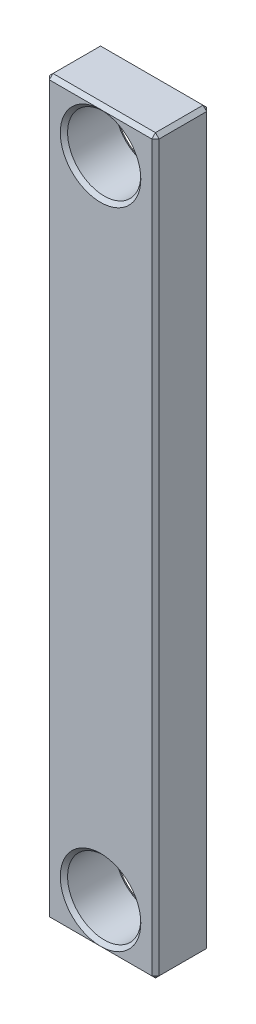
ISO-10303-21;
HEADER;
FILE_DESCRIPTION(('STEP AP214'),'2;1');
FILE_NAME('part.step','',(''),(''),'','','');
FILE_SCHEMA(('AUTOMOTIVE_DESIGN { 1 0 10303 214 1 1 1 1 }'));
ENDSEC;
DATA;
#1=APPLICATION_CONTEXT('core data for automotive mechanical design processes');
#2=APPLICATION_PROTOCOL_DEFINITION('international standard','automotive_design',2000,#1);
#3=PRODUCT_CONTEXT('',#1,'mechanical');
#4=PRODUCT('Part','Part','',(#3));
#5=PRODUCT_RELATED_PRODUCT_CATEGORY('part','',(#4));
#6=PRODUCT_DEFINITION_FORMATION('','',#4);
#7=PRODUCT_DEFINITION_CONTEXT('part definition',#1,'design');
#8=PRODUCT_DEFINITION('design','',#6,#7);
#9=PRODUCT_DEFINITION_SHAPE('','',#8);
#10=(LENGTH_UNIT() NAMED_UNIT(*) SI_UNIT(.MILLI.,.METRE.));
#11=(NAMED_UNIT(*) PLANE_ANGLE_UNIT() SI_UNIT($,.RADIAN.));
#12=(NAMED_UNIT(*) SI_UNIT($,.STERADIAN.) SOLID_ANGLE_UNIT());
#13=UNCERTAINTY_MEASURE_WITH_UNIT(LENGTH_MEASURE(1.E-05),#10,'distance_accuracy_value','');
#14=(GEOMETRIC_REPRESENTATION_CONTEXT(3) GLOBAL_UNCERTAINTY_ASSIGNED_CONTEXT((#13)) GLOBAL_UNIT_ASSIGNED_CONTEXT((#10,
#11,#12)) REPRESENTATION_CONTEXT('',''));
#15=CARTESIAN_POINT('',(0.,0.,0.));
#16=DIRECTION('',(0.,0.,1.));
#17=DIRECTION('',(1.,0.,0.));
#18=AXIS2_PLACEMENT_3D('',#15,#16,#17);
#19=CARTESIAN_POINT('',(0.,0.,15.));
#20=DIRECTION('',(0.,0.,1.));
#21=DIRECTION('',(1.,0.,0.));
#22=AXIS2_PLACEMENT_3D('',#19,#20,#21);
#23=PLANE('',#22);
#24=DIRECTION('',(0.,-1.,0.));
#25=VECTOR('',#24,1.);
#26=CARTESIAN_POINT('',(-14.,-100.,15.));
#27=LINE('',#26,#25);
#28=CARTESIAN_POINT('',(-14.,99.,15.));
#29=VERTEX_POINT('',#28);
#30=CARTESIAN_POINT('',(-14.,-99.,15.));
#31=VERTEX_POINT('',#30);
#32=EDGE_CURVE('E264',#29,#31,#27,.T.);
#33=ORIENTED_EDGE('',*,*,#32,.T.);
#34=DIRECTION('',(1.,0.,0.));
#35=VECTOR('',#34,1.);
#36=CARTESIAN_POINT('',(15.,-99.,15.));
#37=LINE('',#36,#35);
#38=CARTESIAN_POINT('',(0.,-99.,15.));
#39=VERTEX_POINT('',#38);
#40=EDGE_CURVE('E267',#31,#39,#37,.T.);
#41=ORIENTED_EDGE('',*,*,#40,.T.);
#42=CARTESIAN_POINT('',(0.,-88.,15.));
#43=DIRECTION('',(0.,0.,1.));
#44=DIRECTION('',(1.,0.,0.));
#45=AXIS2_PLACEMENT_3D('',#42,#43,#44);
#46=CIRCLE('',#45,11.);
#47=CARTESIAN_POINT('',(11.,-88.,15.));
#48=VERTEX_POINT('',#47);
#49=EDGE_CURVE('E237',#39,#48,#46,.F.);
#50=ORIENTED_EDGE('',*,*,#49,.T.);
#51=CARTESIAN_POINT('',(0.,-88.,15.));
#52=DIRECTION('',(0.,0.,1.));
#53=DIRECTION('',(1.,0.,0.));
#54=AXIS2_PLACEMENT_3D('',#51,#52,#53);
#55=CIRCLE('',#54,11.);
#56=EDGE_CURVE('E240',#48,#39,#55,.F.);
#57=ORIENTED_EDGE('',*,*,#56,.T.);
#58=DIRECTION('',(1.,0.,0.));
#59=VECTOR('',#58,1.);
#60=CARTESIAN_POINT('',(15.,-99.,15.));
#61=LINE('',#60,#59);
#62=CARTESIAN_POINT('',(14.,-99.,15.));
#63=VERTEX_POINT('',#62);
#64=EDGE_CURVE('E244',#39,#63,#61,.T.);
#65=ORIENTED_EDGE('',*,*,#64,.T.);
#66=DIRECTION('',(0.,1.,0.));
#67=VECTOR('',#66,1.);
#68=CARTESIAN_POINT('',(14.,100.,15.));
#69=LINE('',#68,#67);
#70=CARTESIAN_POINT('',(14.,99.,15.));
#71=VERTEX_POINT('',#70);
#72=EDGE_CURVE('E247',#63,#71,#69,.T.);
#73=ORIENTED_EDGE('',*,*,#72,.T.);
#74=DIRECTION('',(-1.,0.,0.));
#75=VECTOR('',#74,1.);
#76=CARTESIAN_POINT('',(-15.,99.,15.));
#77=LINE('',#76,#75);
#78=CARTESIAN_POINT('',(0.,99.,15.));
#79=VERTEX_POINT('',#78);
#80=EDGE_CURVE('E250',#71,#79,#77,.T.);
#81=ORIENTED_EDGE('',*,*,#80,.T.);
#82=CARTESIAN_POINT('',(0.,88.,15.));
#83=DIRECTION('',(0.,0.,1.));
#84=DIRECTION('',(1.,0.,0.));
#85=AXIS2_PLACEMENT_3D('',#82,#83,#84);
#86=CIRCLE('',#85,11.);
#87=CARTESIAN_POINT('',(11.,88.,15.));
#88=VERTEX_POINT('',#87);
#89=EDGE_CURVE('E254',#79,#88,#86,.F.);
#90=ORIENTED_EDGE('',*,*,#89,.T.);
#91=CARTESIAN_POINT('',(0.,88.,15.));
#92=DIRECTION('',(0.,0.,1.));
#93=DIRECTION('',(1.,0.,0.));
#94=AXIS2_PLACEMENT_3D('',#91,#92,#93);
#95=CIRCLE('',#94,11.);
#96=EDGE_CURVE('E257',#88,#79,#95,.F.);
#97=ORIENTED_EDGE('',*,*,#96,.T.);
#98=DIRECTION('',(-1.,0.,0.));
#99=VECTOR('',#98,1.);
#100=CARTESIAN_POINT('',(-15.,99.,15.));
#101=LINE('',#100,#99);
#102=EDGE_CURVE('E261',#79,#29,#101,.T.);
#103=ORIENTED_EDGE('',*,*,#102,.T.);
#104=EDGE_LOOP('',(#33,#41,#50,#57,#65,#73,#81,#90,#97,#103));
#105=FACE_BOUND('',#104,.T.);
#106=ADVANCED_FACE('F39',(#105),#23,.T.);
#107=CARTESIAN_POINT('',(0.,0.,0.));
#108=DIRECTION('',(0.,0.,1.));
#109=DIRECTION('',(1.,0.,0.));
#110=AXIS2_PLACEMENT_3D('',#107,#108,#109);
#111=PLANE('',#110);
#112=DIRECTION('',(0.,-1.,0.));
#113=VECTOR('',#112,1.);
#114=CARTESIAN_POINT('',(14.,0.,0.));
#115=LINE('',#114,#113);
#116=CARTESIAN_POINT('',(14.,99.,0.));
#117=VERTEX_POINT('',#116);
#118=CARTESIAN_POINT('',(14.,-99.,0.));
#119=VERTEX_POINT('',#118);
#120=EDGE_CURVE('E57',#117,#119,#115,.T.);
#121=ORIENTED_EDGE('',*,*,#120,.T.);
#122=DIRECTION('',(-1.,0.,0.));
#123=VECTOR('',#122,1.);
#124=CARTESIAN_POINT('',(0.,-99.,0.));
#125=LINE('',#124,#123);
#126=CARTESIAN_POINT('',(0.,-99.,0.));
#127=VERTEX_POINT('',#126);
#128=EDGE_CURVE('E298',#119,#127,#125,.T.);
#129=ORIENTED_EDGE('',*,*,#128,.T.);
#130=CARTESIAN_POINT('',(0.,-88.,0.));
#131=DIRECTION('',(0.,0.,1.));
#132=DIRECTION('',(1.,0.,0.));
#133=AXIS2_PLACEMENT_3D('',#130,#131,#132);
#134=CIRCLE('',#133,11.);
#135=CARTESIAN_POINT('',(11.,-88.,0.));
#136=VERTEX_POINT('',#135);
#137=EDGE_CURVE('E271',#127,#136,#134,.T.);
#138=ORIENTED_EDGE('',*,*,#137,.T.);
#139=CARTESIAN_POINT('',(0.,-88.,0.));
#140=DIRECTION('',(0.,0.,1.));
#141=DIRECTION('',(1.,0.,0.));
#142=AXIS2_PLACEMENT_3D('',#139,#140,#141);
#143=CIRCLE('',#142,11.);
#144=EDGE_CURVE('E274',#136,#127,#143,.T.);
#145=ORIENTED_EDGE('',*,*,#144,.T.);
#146=DIRECTION('',(-1.,0.,0.));
#147=VECTOR('',#146,1.);
#148=CARTESIAN_POINT('',(0.,-99.,0.));
#149=LINE('',#148,#147);
#150=CARTESIAN_POINT('',(-14.,-99.,0.));
#151=VERTEX_POINT('',#150);
#152=EDGE_CURVE('E278',#127,#151,#149,.T.);
#153=ORIENTED_EDGE('',*,*,#152,.T.);
#154=DIRECTION('',(0.,1.,0.));
#155=VECTOR('',#154,1.);
#156=CARTESIAN_POINT('',(-14.,0.,0.));
#157=LINE('',#156,#155);
#158=CARTESIAN_POINT('',(-14.,99.,0.));
#159=VERTEX_POINT('',#158);
#160=EDGE_CURVE('E281',#151,#159,#157,.T.);
#161=ORIENTED_EDGE('',*,*,#160,.T.);
#162=DIRECTION('',(1.,0.,0.));
#163=VECTOR('',#162,1.);
#164=CARTESIAN_POINT('',(0.,99.,0.));
#165=LINE('',#164,#163);
#166=CARTESIAN_POINT('',(0.,99.,0.));
#167=VERTEX_POINT('',#166);
#168=EDGE_CURVE('E284',#159,#167,#165,.T.);
#169=ORIENTED_EDGE('',*,*,#168,.T.);
#170=CARTESIAN_POINT('',(0.,88.,0.));
#171=DIRECTION('',(0.,0.,1.));
#172=DIRECTION('',(1.,0.,0.));
#173=AXIS2_PLACEMENT_3D('',#170,#171,#172);
#174=CIRCLE('',#173,11.);
#175=CARTESIAN_POINT('',(11.,88.,0.));
#176=VERTEX_POINT('',#175);
#177=EDGE_CURVE('E288',#167,#176,#174,.T.);
#178=ORIENTED_EDGE('',*,*,#177,.T.);
#179=CARTESIAN_POINT('',(0.,88.,0.));
#180=DIRECTION('',(0.,0.,1.));
#181=DIRECTION('',(1.,0.,0.));
#182=AXIS2_PLACEMENT_3D('',#179,#180,#181);
#183=CIRCLE('',#182,11.);
#184=EDGE_CURVE('E291',#176,#167,#183,.T.);
#185=ORIENTED_EDGE('',*,*,#184,.T.);
#186=DIRECTION('',(1.,0.,0.));
#187=VECTOR('',#186,1.);
#188=CARTESIAN_POINT('',(0.,99.,0.));
#189=LINE('',#188,#187);
#190=EDGE_CURVE('E62',#167,#117,#189,.T.);
#191=ORIENTED_EDGE('',*,*,#190,.T.);
#192=EDGE_LOOP('',(#121,#129,#138,#145,#153,#161,#169,#178,#185,#191));
#193=FACE_BOUND('',#192,.T.);
#194=ADVANCED_FACE('F433',(#193),#111,.F.);
#195=CARTESIAN_POINT('',(15.,100.,15.));
#196=DIRECTION('',(-1.,0.,0.));
#197=DIRECTION('',(0.,-1.,0.));
#198=AXIS2_PLACEMENT_3D('',#195,#196,#197);
#199=PLANE('',#198);
#200=DIRECTION('',(0.,1.,0.));
#201=VECTOR('',#200,1.);
#202=CARTESIAN_POINT('',(15.,100.,0.999999999999973));
#203=LINE('',#202,#201);
#204=CARTESIAN_POINT('',(15.,-99.,0.999999999999973));
#205=VERTEX_POINT('',#204);
#206=CARTESIAN_POINT('',(15.,99.,0.999999999999973));
#207=VERTEX_POINT('',#206);
#208=EDGE_CURVE('E197',#205,#207,#203,.T.);
#209=ORIENTED_EDGE('',*,*,#208,.T.);
#210=DIRECTION('',(0.,0.,1.));
#211=VECTOR('',#210,1.);
#212=CARTESIAN_POINT('',(15.,99.,15.));
#213=LINE('',#212,#211);
#214=CARTESIAN_POINT('',(15.,99.,14.));
#215=VERTEX_POINT('',#214);
#216=EDGE_CURVE('E162',#207,#215,#213,.T.);
#217=ORIENTED_EDGE('',*,*,#216,.T.);
#218=DIRECTION('',(0.,-1.,0.));
#219=VECTOR('',#218,1.);
#220=CARTESIAN_POINT('',(15.,-100.,14.));
#221=LINE('',#220,#219);
#222=CARTESIAN_POINT('',(15.,-99.,14.));
#223=VERTEX_POINT('',#222);
#224=EDGE_CURVE('E206',#215,#223,#221,.T.);
#225=ORIENTED_EDGE('',*,*,#224,.T.);
#226=DIRECTION('',(0.,0.,-1.));
#227=VECTOR('',#226,1.);
#228=CARTESIAN_POINT('',(15.,-99.,15.));
#229=LINE('',#228,#227);
#230=EDGE_CURVE('E203',#223,#205,#229,.T.);
#231=ORIENTED_EDGE('',*,*,#230,.T.);
#232=EDGE_LOOP('',(#209,#217,#225,#231));
#233=FACE_BOUND('',#232,.T.);
#234=ADVANCED_FACE('F435',(#233),#199,.F.);
#235=CARTESIAN_POINT('',(-15.,100.,15.));
#236=DIRECTION('',(0.,-1.,0.));
#237=DIRECTION('',(0.,0.,-1.));
#238=AXIS2_PLACEMENT_3D('',#235,#236,#237);
#239=PLANE('',#238);
#240=DIRECTION('',(0.,0.,1.));
#241=VECTOR('',#240,1.);
#242=CARTESIAN_POINT('',(-14.,100.,15.));
#243=LINE('',#242,#241);
#244=CARTESIAN_POINT('',(-14.,100.,0.999999999999973));
#245=VERTEX_POINT('',#244);
#246=CARTESIAN_POINT('',(-14.,100.,14.));
#247=VERTEX_POINT('',#246);
#248=EDGE_CURVE('E187',#245,#247,#243,.T.);
#249=ORIENTED_EDGE('',*,*,#248,.T.);
#250=DIRECTION('',(1.,0.,0.));
#251=VECTOR('',#250,1.);
#252=CARTESIAN_POINT('',(15.,100.,14.));
#253=LINE('',#252,#251);
#254=CARTESIAN_POINT('',(14.,100.,14.));
#255=VERTEX_POINT('',#254);
#256=EDGE_CURVE('E191',#247,#255,#253,.T.);
#257=ORIENTED_EDGE('',*,*,#256,.T.);
#258=DIRECTION('',(0.,0.,-1.));
#259=VECTOR('',#258,1.);
#260=CARTESIAN_POINT('',(14.,100.,15.));
#261=LINE('',#260,#259);
#262=CARTESIAN_POINT('',(14.,100.,0.999999999999973));
#263=VERTEX_POINT('',#262);
#264=EDGE_CURVE('E160',#255,#263,#261,.T.);
#265=ORIENTED_EDGE('',*,*,#264,.T.);
#266=DIRECTION('',(-1.,0.,0.));
#267=VECTOR('',#266,1.);
#268=CARTESIAN_POINT('',(-15.,100.,0.999999999999973));
#269=LINE('',#268,#267);
#270=EDGE_CURVE('E179',#263,#245,#269,.T.);
#271=ORIENTED_EDGE('',*,*,#270,.T.);
#272=EDGE_LOOP('',(#249,#257,#265,#271));
#273=FACE_BOUND('',#272,.T.);
#274=ADVANCED_FACE('F189',(#273),#239,.F.);
#275=CARTESIAN_POINT('',(-15.,100.,15.));
#276=DIRECTION('',(1.,0.,0.));
#277=DIRECTION('',(0.,1.,0.));
#278=AXIS2_PLACEMENT_3D('',#275,#276,#277);
#279=PLANE('',#278);
#280=DIRECTION('',(0.,0.,1.));
#281=VECTOR('',#280,1.);
#282=CARTESIAN_POINT('',(-15.,-99.,15.));
#283=LINE('',#282,#281);
#284=CARTESIAN_POINT('',(-15.,-99.,0.999999999999973));
#285=VERTEX_POINT('',#284);
#286=CARTESIAN_POINT('',(-15.,-99.,14.));
#287=VERTEX_POINT('',#286);
#288=EDGE_CURVE('E214',#285,#287,#283,.T.);
#289=ORIENTED_EDGE('',*,*,#288,.T.);
#290=DIRECTION('',(0.,1.,0.));
#291=VECTOR('',#290,1.);
#292=CARTESIAN_POINT('',(-15.,100.,14.));
#293=LINE('',#292,#291);
#294=CARTESIAN_POINT('',(-15.,99.,14.));
#295=VERTEX_POINT('',#294);
#296=EDGE_CURVE('E221',#287,#295,#293,.T.);
#297=ORIENTED_EDGE('',*,*,#296,.T.);
#298=DIRECTION('',(0.,0.,-1.));
#299=VECTOR('',#298,1.);
#300=CARTESIAN_POINT('',(-15.,99.,15.));
#301=LINE('',#300,#299);
#302=CARTESIAN_POINT('',(-15.,99.,0.999999999999973));
#303=VERTEX_POINT('',#302);
#304=EDGE_CURVE('E217',#295,#303,#301,.T.);
#305=ORIENTED_EDGE('',*,*,#304,.T.);
#306=DIRECTION('',(0.,-1.,0.));
#307=VECTOR('',#306,1.);
#308=CARTESIAN_POINT('',(-15.,100.,0.999999999999973));
#309=LINE('',#308,#307);
#310=EDGE_CURVE('E211',#303,#285,#309,.T.);
#311=ORIENTED_EDGE('',*,*,#310,.T.);
#312=EDGE_LOOP('',(#289,#297,#305,#311));
#313=FACE_BOUND('',#312,.T.);
#314=ADVANCED_FACE('F449',(#313),#279,.F.);
#315=CARTESIAN_POINT('',(-15.,-100.,15.));
#316=DIRECTION('',(0.,1.,0.));
#317=DIRECTION('',(0.,0.,1.));
#318=AXIS2_PLACEMENT_3D('',#315,#316,#317);
#319=PLANE('',#318);
#320=DIRECTION('',(-1.,0.,0.));
#321=VECTOR('',#320,1.);
#322=CARTESIAN_POINT('',(-15.,-100.,14.));
#323=LINE('',#322,#321);
#324=CARTESIAN_POINT('',(14.,-100.,14.));
#325=VERTEX_POINT('',#324);
#326=CARTESIAN_POINT('',(-14.,-100.,14.));
#327=VERTEX_POINT('',#326);
#328=EDGE_CURVE('E230',#325,#327,#323,.T.);
#329=ORIENTED_EDGE('',*,*,#328,.T.);
#330=DIRECTION('',(0.,0.,-1.));
#331=VECTOR('',#330,1.);
#332=CARTESIAN_POINT('',(-14.,-100.,15.));
#333=LINE('',#332,#331);
#334=CARTESIAN_POINT('',(-14.,-100.,0.999999999999973));
#335=VERTEX_POINT('',#334);
#336=EDGE_CURVE('E233',#327,#335,#333,.T.);
#337=ORIENTED_EDGE('',*,*,#336,.T.);
#338=DIRECTION('',(1.,0.,0.));
#339=VECTOR('',#338,1.);
#340=CARTESIAN_POINT('',(-15.,-100.,0.999999999999973));
#341=LINE('',#340,#339);
#342=CARTESIAN_POINT('',(14.,-100.,0.999999999999973));
#343=VERTEX_POINT('',#342);
#344=EDGE_CURVE('E224',#335,#343,#341,.T.);
#345=ORIENTED_EDGE('',*,*,#344,.T.);
#346=DIRECTION('',(0.,0.,1.));
#347=VECTOR('',#346,1.);
#348=CARTESIAN_POINT('',(14.,-100.,15.));
#349=LINE('',#348,#347);
#350=EDGE_CURVE('E227',#343,#325,#349,.T.);
#351=ORIENTED_EDGE('',*,*,#350,.T.);
#352=EDGE_LOOP('',(#329,#337,#345,#351));
#353=FACE_BOUND('',#352,.T.);
#354=ADVANCED_FACE('F446',(#353),#319,.F.);
#355=CARTESIAN_POINT('',(0.,88.,15.));
#356=DIRECTION('',(0.,0.,-1.));
#357=DIRECTION('',(-1.,0.,0.));
#358=AXIS2_PLACEMENT_3D('',#355,#356,#357);
#359=CYLINDRICAL_SURFACE('',#358,10.);
#360=CARTESIAN_POINT('',(0.,88.,14.));
#361=DIRECTION('',(0.,0.,1.));
#362=DIRECTION('',(1.,0.,0.));
#363=AXIS2_PLACEMENT_3D('',#360,#361,#362);
#364=CIRCLE('',#363,10.);
#365=CARTESIAN_POINT('',(10.,88.,14.));
#366=VERTEX_POINT('',#365);
#367=EDGE_CURVE('E305',#366,#366,#364,.T.);
#368=ORIENTED_EDGE('',*,*,#367,.T.);
#369=EDGE_LOOP('',(#368));
#370=FACE_BOUND('',#369,.T.);
#371=CARTESIAN_POINT('',(0.,88.,1.));
#372=DIRECTION('',(0.,0.,1.));
#373=DIRECTION('',(1.,0.,0.));
#374=AXIS2_PLACEMENT_3D('',#371,#372,#373);
#375=CIRCLE('',#374,10.);
#376=CARTESIAN_POINT('',(10.,88.,1.));
#377=VERTEX_POINT('',#376);
#378=EDGE_CURVE('E301',#377,#377,#375,.F.);
#379=ORIENTED_EDGE('',*,*,#378,.T.);
#380=EDGE_LOOP('',(#379));
#381=FACE_BOUND('',#380,.T.);
#382=ADVANCED_FACE('F422',(#370,#381),#359,.F.);
#383=CARTESIAN_POINT('',(0.,-88.,15.));
#384=DIRECTION('',(0.,0.,-1.));
#385=DIRECTION('',(-1.,0.,0.));
#386=AXIS2_PLACEMENT_3D('',#383,#384,#385);
#387=CYLINDRICAL_SURFACE('',#386,10.);
#388=CARTESIAN_POINT('',(0.,-88.,14.));
#389=DIRECTION('',(0.,0.,1.));
#390=DIRECTION('',(1.,0.,0.));
#391=AXIS2_PLACEMENT_3D('',#388,#389,#390);
#392=CIRCLE('',#391,10.);
#393=CARTESIAN_POINT('',(10.,-88.,14.));
#394=VERTEX_POINT('',#393);
#395=EDGE_CURVE('E11',#394,#394,#392,.T.);
#396=ORIENTED_EDGE('',*,*,#395,.T.);
#397=EDGE_LOOP('',(#396));
#398=FACE_BOUND('',#397,.T.);
#399=CARTESIAN_POINT('',(0.,-88.,1.));
#400=DIRECTION('',(0.,0.,1.));
#401=DIRECTION('',(1.,0.,0.));
#402=AXIS2_PLACEMENT_3D('',#399,#400,#401);
#403=CIRCLE('',#402,10.);
#404=CARTESIAN_POINT('',(10.,-88.,1.));
#405=VERTEX_POINT('',#404);
#406=EDGE_CURVE('E49',#405,#405,#403,.F.);
#407=ORIENTED_EDGE('',*,*,#406,.T.);
#408=EDGE_LOOP('',(#407));
#409=FACE_BOUND('',#408,.T.);
#410=ADVANCED_FACE('F418',(#398,#409),#387,.F.);
#411=CARTESIAN_POINT('',(-14.,-100.,15.));
#412=DIRECTION('',(0.707106781186548,0.707106781186548,0.));
#413=DIRECTION('',(0.,0.,-1.));
#414=AXIS2_PLACEMENT_3D('',#411,#412,#413);
#415=PLANE('',#414);
#416=DIRECTION('',(-0.707106781186547,0.707106781186547,0.));
#417=VECTOR('',#416,1.);
#418=CARTESIAN_POINT('',(-15.,-99.,14.));
#419=LINE('',#418,#417);
#420=EDGE_CURVE('E43',#287,#327,#419,.F.);
#421=ORIENTED_EDGE('',*,*,#420,.F.);
#422=ORIENTED_EDGE('',*,*,#288,.F.);
#423=DIRECTION('',(0.707106781186547,-0.707106781186547,0.));
#424=VECTOR('',#423,1.);
#425=CARTESIAN_POINT('',(-14.,-100.,0.999999999999973));
#426=LINE('',#425,#424);
#427=EDGE_CURVE('E383',#335,#285,#426,.F.);
#428=ORIENTED_EDGE('',*,*,#427,.F.);
#429=ORIENTED_EDGE('',*,*,#336,.F.);
#430=EDGE_LOOP('',(#421,#422,#428,#429));
#431=FACE_BOUND('',#430,.T.);
#432=ADVANCED_FACE('F421',(#431),#415,.F.);
#433=CARTESIAN_POINT('',(-15.,-99.,14.));
#434=DIRECTION('',(-0.577350269189626,-0.577350269189626,0.577350269189626));
#435=DIRECTION('',(0.707106781186548,0.,0.707106781186548));
#436=AXIS2_PLACEMENT_3D('',#433,#434,#435);
#437=PLANE('',#436);
#438=DIRECTION('',(-0.707106781186548,0.,-0.707106781186548));
#439=VECTOR('',#438,1.);
#440=CARTESIAN_POINT('',(-15.,-99.,14.));
#441=LINE('',#440,#439);
#442=EDGE_CURVE('E376',#287,#31,#441,.F.);
#443=ORIENTED_EDGE('',*,*,#442,.F.);
#444=ORIENTED_EDGE('',*,*,#420,.T.);
#445=DIRECTION('',(0.,0.707106781186547,0.707106781186547));
#446=VECTOR('',#445,1.);
#447=CARTESIAN_POINT('',(-14.,-99.5,14.5));
#448=LINE('',#447,#446);
#449=EDGE_CURVE('E380',#31,#327,#448,.F.);
#450=ORIENTED_EDGE('',*,*,#449,.F.);
#451=EDGE_LOOP('',(#443,#444,#450));
#452=FACE_BOUND('',#451,.T.);
#453=ADVANCED_FACE('F396',(#452),#437,.T.);
#454=CARTESIAN_POINT('',(-14.,-100.,0.999999999999973));
#455=DIRECTION('',(-0.577350269189626,-0.577350269189626,-0.577350269189626));
#456=DIRECTION('',(-0.707106781186548,0.,0.707106781186548));
#457=AXIS2_PLACEMENT_3D('',#454,#455,#456);
#458=PLANE('',#457);
#459=DIRECTION('',(0.,0.707106781186547,-0.707106781186547));
#460=VECTOR('',#459,1.);
#461=CARTESIAN_POINT('',(-14.,-100.,0.999999999999973));
#462=LINE('',#461,#460);
#463=EDGE_CURVE('E368',#335,#151,#462,.T.);
#464=ORIENTED_EDGE('',*,*,#463,.F.);
#465=ORIENTED_EDGE('',*,*,#427,.T.);
#466=DIRECTION('',(-0.707106781186548,0.,0.707106781186548));
#467=VECTOR('',#466,1.);
#468=CARTESIAN_POINT('',(-14.5,-99.,0.499999999999986));
#469=LINE('',#468,#467);
#470=EDGE_CURVE('E372',#151,#285,#469,.T.);
#471=ORIENTED_EDGE('',*,*,#470,.F.);
#472=EDGE_LOOP('',(#464,#465,#471));
#473=FACE_BOUND('',#472,.T.);
#474=ADVANCED_FACE('F515',(#473),#458,.T.);
#475=CARTESIAN_POINT('',(0.,-99.,15.));
#476=DIRECTION('',(0.,-0.707106781186548,0.707106781186548));
#477=DIRECTION('',(-1.,0.,0.));
#478=AXIS2_PLACEMENT_3D('',#475,#476,#477);
#479=PLANE('',#478);
#480=ORIENTED_EDGE('',*,*,#449,.T.);
#481=ORIENTED_EDGE('',*,*,#328,.F.);
#482=DIRECTION('',(0.,-0.707106781186547,-0.707106781186547));
#483=VECTOR('',#482,1.);
#484=CARTESIAN_POINT('',(14.,-99.,15.));
#485=LINE('',#484,#483);
#486=EDGE_CURVE('E360',#63,#325,#485,.T.);
#487=ORIENTED_EDGE('',*,*,#486,.F.);
#488=ORIENTED_EDGE('',*,*,#64,.F.);
#489=ORIENTED_EDGE('',*,*,#40,.F.);
#490=EDGE_LOOP('',(#480,#481,#487,#488,#489));
#491=FACE_BOUND('',#490,.T.);
#492=ADVANCED_FACE('F404',(#491),#479,.T.);
#493=CARTESIAN_POINT('',(-14.,0.,15.));
#494=DIRECTION('',(-0.707106781186548,0.,0.707106781186548));
#495=DIRECTION('',(0.,1.,0.));
#496=AXIS2_PLACEMENT_3D('',#493,#494,#495);
#497=PLANE('',#496);
#498=ORIENTED_EDGE('',*,*,#442,.T.);
#499=ORIENTED_EDGE('',*,*,#32,.F.);
#500=DIRECTION('',(0.707106781186547,0.,0.707106781186547));
#501=VECTOR('',#500,1.);
#502=CARTESIAN_POINT('',(-14.5,99.,14.5));
#503=LINE('',#502,#501);
#504=EDGE_CURVE('E356',#295,#29,#503,.T.);
#505=ORIENTED_EDGE('',*,*,#504,.F.);
#506=ORIENTED_EDGE('',*,*,#296,.F.);
#507=EDGE_LOOP('',(#498,#499,#505,#506));
#508=FACE_BOUND('',#507,.T.);
#509=ADVANCED_FACE('F508',(#508),#497,.T.);
#510=CARTESIAN_POINT('',(-15.,99.,15.));
#511=DIRECTION('',(0.707106781186548,-0.707106781186548,0.));
#512=DIRECTION('',(0.,0.,-1.));
#513=AXIS2_PLACEMENT_3D('',#510,#511,#512);
#514=PLANE('',#513);
#515=DIRECTION('',(-0.707106781186547,-0.707106781186547,0.));
#516=VECTOR('',#515,1.);
#517=CARTESIAN_POINT('',(-15.,99.,0.999999999999973));
#518=LINE('',#517,#516);
#519=EDGE_CURVE('E348',#303,#245,#518,.F.);
#520=ORIENTED_EDGE('',*,*,#519,.F.);
#521=ORIENTED_EDGE('',*,*,#304,.F.);
#522=DIRECTION('',(0.707106781186547,0.707106781186547,0.));
#523=VECTOR('',#522,1.);
#524=CARTESIAN_POINT('',(-14.,100.,14.));
#525=LINE('',#524,#523);
#526=EDGE_CURVE('E352',#247,#295,#525,.F.);
#527=ORIENTED_EDGE('',*,*,#526,.F.);
#528=ORIENTED_EDGE('',*,*,#248,.F.);
#529=EDGE_LOOP('',(#520,#521,#527,#528));
#530=FACE_BOUND('',#529,.T.);
#531=ADVANCED_FACE('F504',(#530),#514,.F.);
#532=CARTESIAN_POINT('',(-15.,100.,0.999999999999973));
#533=DIRECTION('',(0.707106781186548,0.,0.707106781186548));
#534=DIRECTION('',(0.,-1.,0.));
#535=AXIS2_PLACEMENT_3D('',#532,#533,#534);
#536=PLANE('',#535);
#537=ORIENTED_EDGE('',*,*,#470,.T.);
#538=ORIENTED_EDGE('',*,*,#310,.F.);
#539=DIRECTION('',(0.707106781186547,0.,-0.707106781186547));
#540=VECTOR('',#539,1.);
#541=CARTESIAN_POINT('',(-15.,99.,0.999999999999973));
#542=LINE('',#541,#540);
#543=EDGE_CURVE('E345',#159,#303,#542,.F.);
#544=ORIENTED_EDGE('',*,*,#543,.F.);
#545=ORIENTED_EDGE('',*,*,#160,.F.);
#546=EDGE_LOOP('',(#537,#538,#544,#545));
#547=FACE_BOUND('',#546,.T.);
#548=ADVANCED_FACE('F501',(#547),#536,.F.);
#549=CARTESIAN_POINT('',(-15.,-100.,0.999999999999973));
#550=DIRECTION('',(0.,0.707106781186548,0.707106781186548));
#551=DIRECTION('',(1.,0.,0.));
#552=AXIS2_PLACEMENT_3D('',#549,#550,#551);
#553=PLANE('',#552);
#554=ORIENTED_EDGE('',*,*,#152,.F.);
#555=ORIENTED_EDGE('',*,*,#128,.F.);
#556=DIRECTION('',(0.,-0.707106781186547,0.707106781186547));
#557=VECTOR('',#556,1.);
#558=CARTESIAN_POINT('',(14.,-99.5,0.499999999999987));
#559=LINE('',#558,#557);
#560=EDGE_CURVE('E341',#343,#119,#559,.F.);
#561=ORIENTED_EDGE('',*,*,#560,.F.);
#562=ORIENTED_EDGE('',*,*,#344,.F.);
#563=ORIENTED_EDGE('',*,*,#463,.T.);
#564=EDGE_LOOP('',(#554,#555,#561,#562,#563));
#565=FACE_BOUND('',#564,.T.);
#566=ADVANCED_FACE('F431',(#565),#553,.F.);
#567=CARTESIAN_POINT('',(15.,-99.,15.));
#568=DIRECTION('',(-0.707106781186548,0.707106781186548,0.));
#569=DIRECTION('',(0.,0.,-1.));
#570=AXIS2_PLACEMENT_3D('',#567,#568,#569);
#571=PLANE('',#570);
#572=DIRECTION('',(-0.707106781186547,-0.707106781186547,0.));
#573=VECTOR('',#572,1.);
#574=CARTESIAN_POINT('',(14.5,-99.5,14.));
#575=LINE('',#574,#573);
#576=EDGE_CURVE('E364',#325,#223,#575,.F.);
#577=ORIENTED_EDGE('',*,*,#576,.F.);
#578=ORIENTED_EDGE('',*,*,#350,.F.);
#579=DIRECTION('',(0.707106781186547,0.707106781186547,0.));
#580=VECTOR('',#579,1.);
#581=CARTESIAN_POINT('',(15.,-99.,0.999999999999973));
#582=LINE('',#581,#580);
#583=EDGE_CURVE('E337',#205,#343,#582,.F.);
#584=ORIENTED_EDGE('',*,*,#583,.F.);
#585=ORIENTED_EDGE('',*,*,#230,.F.);
#586=EDGE_LOOP('',(#577,#578,#584,#585));
#587=FACE_BOUND('',#586,.T.);
#588=ADVANCED_FACE('F494',(#587),#571,.F.);
#589=CARTESIAN_POINT('',(14.,-99.,15.));
#590=DIRECTION('',(0.577350269189626,-0.577350269189626,0.577350269189626));
#591=DIRECTION('',(0.707106781186548,0.,-0.707106781186548));
#592=AXIS2_PLACEMENT_3D('',#589,#590,#591);
#593=PLANE('',#592);
#594=ORIENTED_EDGE('',*,*,#486,.T.);
#595=ORIENTED_EDGE('',*,*,#576,.T.);
#596=DIRECTION('',(-0.707106781186547,0.,0.707106781186547));
#597=VECTOR('',#596,1.);
#598=CARTESIAN_POINT('',(14.,-99.,15.));
#599=LINE('',#598,#597);
#600=EDGE_CURVE('E333',#63,#223,#599,.F.);
#601=ORIENTED_EDGE('',*,*,#600,.F.);
#602=EDGE_LOOP('',(#594,#595,#601));
#603=FACE_BOUND('',#602,.T.);
#604=ADVANCED_FACE('F490',(#603),#593,.T.);
#605=CARTESIAN_POINT('',(-14.,100.,14.));
#606=DIRECTION('',(-0.577350269189626,0.577350269189626,0.577350269189626));
#607=DIRECTION('',(0.707106781186548,0.,0.707106781186548));
#608=AXIS2_PLACEMENT_3D('',#605,#606,#607);
#609=PLANE('',#608);
#610=ORIENTED_EDGE('',*,*,#526,.T.);
#611=ORIENTED_EDGE('',*,*,#504,.T.);
#612=DIRECTION('',(0.,0.707106781186547,-0.707106781186547));
#613=VECTOR('',#612,1.);
#614=CARTESIAN_POINT('',(-14.,100.,14.));
#615=LINE('',#614,#613);
#616=EDGE_CURVE('E329',#247,#29,#615,.F.);
#617=ORIENTED_EDGE('',*,*,#616,.F.);
#618=EDGE_LOOP('',(#610,#611,#617));
#619=FACE_BOUND('',#618,.T.);
#620=ADVANCED_FACE('F486',(#619),#609,.T.);
#621=CARTESIAN_POINT('',(-15.,99.,0.999999999999973));
#622=DIRECTION('',(-0.577350269189626,0.577350269189626,-0.577350269189626));
#623=DIRECTION('',(-0.707106781186548,0.,0.707106781186548));
#624=AXIS2_PLACEMENT_3D('',#621,#622,#623);
#625=PLANE('',#624);
#626=ORIENTED_EDGE('',*,*,#543,.T.);
#627=ORIENTED_EDGE('',*,*,#519,.T.);
#628=DIRECTION('',(0.,0.707106781186547,0.707106781186547));
#629=VECTOR('',#628,1.);
#630=CARTESIAN_POINT('',(-14.,99.5,0.499999999999987));
#631=LINE('',#630,#629);
#632=EDGE_CURVE('E183',#159,#245,#631,.T.);
#633=ORIENTED_EDGE('',*,*,#632,.F.);
#634=EDGE_LOOP('',(#626,#627,#633));
#635=FACE_BOUND('',#634,.T.);
#636=ADVANCED_FACE('F482',(#635),#625,.T.);
#637=CARTESIAN_POINT('',(15.,-99.,0.999999999999973));
#638=DIRECTION('',(0.577350269189626,-0.577350269189626,-0.577350269189626));
#639=DIRECTION('',(-0.707106781186548,0.,-0.707106781186548));
#640=AXIS2_PLACEMENT_3D('',#637,#638,#639);
#641=PLANE('',#640);
#642=ORIENTED_EDGE('',*,*,#583,.T.);
#643=ORIENTED_EDGE('',*,*,#560,.T.);
#644=DIRECTION('',(-0.707106781186547,0.,-0.707106781186547));
#645=VECTOR('',#644,1.);
#646=CARTESIAN_POINT('',(15.,-99.,0.999999999999973));
#647=LINE('',#646,#645);
#648=EDGE_CURVE('E323',#205,#119,#647,.T.);
#649=ORIENTED_EDGE('',*,*,#648,.F.);
#650=EDGE_LOOP('',(#642,#643,#649));
#651=FACE_BOUND('',#650,.T.);
#652=ADVANCED_FACE('F478',(#651),#641,.T.);
#653=CARTESIAN_POINT('',(14.,0.,15.));
#654=DIRECTION('',(0.707106781186548,0.,0.707106781186548));
#655=DIRECTION('',(0.,-1.,0.));
#656=AXIS2_PLACEMENT_3D('',#653,#654,#655);
#657=PLANE('',#656);
#658=ORIENTED_EDGE('',*,*,#600,.T.);
#659=ORIENTED_EDGE('',*,*,#224,.F.);
#660=DIRECTION('',(0.707106781186548,0.,-0.707106781186548));
#661=VECTOR('',#660,1.);
#662=CARTESIAN_POINT('',(15.,99.,14.));
#663=LINE('',#662,#661);
#664=EDGE_CURVE('E319',#71,#215,#663,.T.);
#665=ORIENTED_EDGE('',*,*,#664,.F.);
#666=ORIENTED_EDGE('',*,*,#72,.F.);
#667=EDGE_LOOP('',(#658,#659,#665,#666));
#668=FACE_BOUND('',#667,.T.);
#669=ADVANCED_FACE('F474',(#668),#657,.T.);
#670=CARTESIAN_POINT('',(0.,99.,15.));
#671=DIRECTION('',(0.,0.707106781186548,0.707106781186548));
#672=DIRECTION('',(1.,0.,0.));
#673=AXIS2_PLACEMENT_3D('',#670,#671,#672);
#674=PLANE('',#673);
#675=ORIENTED_EDGE('',*,*,#102,.F.);
#676=ORIENTED_EDGE('',*,*,#80,.F.);
#677=DIRECTION('',(0.,-0.707106781186547,0.707106781186547));
#678=VECTOR('',#677,1.);
#679=CARTESIAN_POINT('',(14.,99.5,14.5));
#680=LINE('',#679,#678);
#681=EDGE_CURVE('E176',#255,#71,#680,.T.);
#682=ORIENTED_EDGE('',*,*,#681,.F.);
#683=ORIENTED_EDGE('',*,*,#256,.F.);
#684=ORIENTED_EDGE('',*,*,#616,.T.);
#685=EDGE_LOOP('',(#675,#676,#682,#683,#684));
#686=FACE_BOUND('',#685,.T.);
#687=ADVANCED_FACE('F471',(#686),#674,.T.);
#688=CARTESIAN_POINT('',(-15.,100.,0.999999999999973));
#689=DIRECTION('',(0.,-0.707106781186548,0.707106781186548));
#690=DIRECTION('',(-1.,0.,0.));
#691=AXIS2_PLACEMENT_3D('',#688,#689,#690);
#692=PLANE('',#691);
#693=ORIENTED_EDGE('',*,*,#632,.T.);
#694=ORIENTED_EDGE('',*,*,#270,.F.);
#695=DIRECTION('',(0.,-0.707106781186547,-0.707106781186547));
#696=VECTOR('',#695,1.);
#697=CARTESIAN_POINT('',(14.,100.,0.999999999999973));
#698=LINE('',#697,#696);
#699=EDGE_CURVE('E169',#117,#263,#698,.F.);
#700=ORIENTED_EDGE('',*,*,#699,.F.);
#701=ORIENTED_EDGE('',*,*,#190,.F.);
#702=ORIENTED_EDGE('',*,*,#168,.F.);
#703=EDGE_LOOP('',(#693,#694,#700,#701,#702));
#704=FACE_BOUND('',#703,.T.);
#705=ADVANCED_FACE('F180',(#704),#692,.F.);
#706=CARTESIAN_POINT('',(15.,100.,0.999999999999973));
#707=DIRECTION('',(-0.707106781186548,0.,0.707106781186548));
#708=DIRECTION('',(0.,1.,0.));
#709=AXIS2_PLACEMENT_3D('',#706,#707,#708);
#710=PLANE('',#709);
#711=ORIENTED_EDGE('',*,*,#648,.T.);
#712=ORIENTED_EDGE('',*,*,#120,.F.);
#713=DIRECTION('',(0.707106781186548,0.,0.707106781186548));
#714=VECTOR('',#713,1.);
#715=CARTESIAN_POINT('',(14.5,99.,0.499999999999986));
#716=LINE('',#715,#714);
#717=EDGE_CURVE('E173',#207,#117,#716,.F.);
#718=ORIENTED_EDGE('',*,*,#717,.F.);
#719=ORIENTED_EDGE('',*,*,#208,.F.);
#720=EDGE_LOOP('',(#711,#712,#718,#719));
#721=FACE_BOUND('',#720,.T.);
#722=ADVANCED_FACE('F464',(#721),#710,.F.);
#723=CARTESIAN_POINT('',(15.,99.,14.));
#724=DIRECTION('',(0.577350269189626,0.577350269189626,0.577350269189626));
#725=DIRECTION('',(0.707106781186548,0.,-0.707106781186548));
#726=AXIS2_PLACEMENT_3D('',#723,#724,#725);
#727=PLANE('',#726);
#728=ORIENTED_EDGE('',*,*,#681,.T.);
#729=ORIENTED_EDGE('',*,*,#664,.T.);
#730=DIRECTION('',(0.707106781186547,-0.707106781186547,0.));
#731=VECTOR('',#730,1.);
#732=CARTESIAN_POINT('',(15.,99.,14.));
#733=LINE('',#732,#731);
#734=EDGE_CURVE('E166',#255,#215,#733,.T.);
#735=ORIENTED_EDGE('',*,*,#734,.F.);
#736=EDGE_LOOP('',(#728,#729,#735));
#737=FACE_BOUND('',#736,.T.);
#738=ADVANCED_FACE('F461',(#737),#727,.T.);
#739=CARTESIAN_POINT('',(14.,100.,0.999999999999973));
#740=DIRECTION('',(0.577350269189626,0.577350269189626,-0.577350269189626));
#741=DIRECTION('',(-0.707106781186548,0.,-0.707106781186548));
#742=AXIS2_PLACEMENT_3D('',#739,#740,#741);
#743=PLANE('',#742);
#744=ORIENTED_EDGE('',*,*,#717,.T.);
#745=ORIENTED_EDGE('',*,*,#699,.T.);
#746=DIRECTION('',(-0.707106781186547,0.707106781186547,0.));
#747=VECTOR('',#746,1.);
#748=CARTESIAN_POINT('',(14.,100.,0.999999999999973));
#749=LINE('',#748,#747);
#750=EDGE_CURVE('E156',#207,#263,#749,.T.);
#751=ORIENTED_EDGE('',*,*,#750,.F.);
#752=EDGE_LOOP('',(#744,#745,#751));
#753=FACE_BOUND('',#752,.T.);
#754=ADVANCED_FACE('F171',(#753),#743,.T.);
#755=CARTESIAN_POINT('',(14.,100.,15.));
#756=DIRECTION('',(-0.707106781186548,-0.707106781186548,0.));
#757=DIRECTION('',(0.,0.,-1.));
#758=AXIS2_PLACEMENT_3D('',#755,#756,#757);
#759=PLANE('',#758);
#760=ORIENTED_EDGE('',*,*,#734,.T.);
#761=ORIENTED_EDGE('',*,*,#216,.F.);
#762=ORIENTED_EDGE('',*,*,#750,.T.);
#763=ORIENTED_EDGE('',*,*,#264,.F.);
#764=EDGE_LOOP('',(#760,#761,#762,#763));
#765=FACE_BOUND('',#764,.T.);
#766=ADVANCED_FACE('F158',(#765),#759,.F.);
#767=CARTESIAN_POINT('',(0.,88.,14.));
#768=DIRECTION('',(0.,0.,1.));
#769=DIRECTION('',(1.,0.,0.));
#770=AXIS2_PLACEMENT_3D('',#767,#768,#769);
#771=CONICAL_SURFACE('',#770,10.,0.785398163397445);
#772=ORIENTED_EDGE('',*,*,#89,.F.);
#773=ORIENTED_EDGE('',*,*,#96,.F.);
#774=EDGE_LOOP('',(#772,#773));
#775=FACE_BOUND('',#774,.T.);
#776=ORIENTED_EDGE('',*,*,#367,.F.);
#777=EDGE_LOOP('',(#776));
#778=FACE_BOUND('',#777,.T.);
#779=ADVANCED_FACE('F458',(#775,#778),#771,.F.);
#780=CARTESIAN_POINT('',(0.,88.,0.));
#781=DIRECTION('',(0.,0.,-1.));
#782=DIRECTION('',(-1.,0.,0.));
#783=AXIS2_PLACEMENT_3D('',#780,#781,#782);
#784=CONICAL_SURFACE('',#783,11.,0.785398163397452);
#785=ORIENTED_EDGE('',*,*,#378,.F.);
#786=EDGE_LOOP('',(#785));
#787=FACE_BOUND('',#786,.T.);
#788=ORIENTED_EDGE('',*,*,#177,.F.);
#789=ORIENTED_EDGE('',*,*,#184,.F.);
#790=EDGE_LOOP('',(#788,#789));
#791=FACE_BOUND('',#790,.T.);
#792=ADVANCED_FACE('F415',(#787,#791),#784,.F.);
#793=CARTESIAN_POINT('',(0.,-88.,14.));
#794=DIRECTION('',(0.,0.,1.));
#795=DIRECTION('',(1.,0.,0.));
#796=AXIS2_PLACEMENT_3D('',#793,#794,#795);
#797=CONICAL_SURFACE('',#796,10.,0.785398163397445);
#798=ORIENTED_EDGE('',*,*,#49,.F.);
#799=ORIENTED_EDGE('',*,*,#56,.F.);
#800=EDGE_LOOP('',(#798,#799));
#801=FACE_BOUND('',#800,.T.);
#802=ORIENTED_EDGE('',*,*,#395,.F.);
#803=EDGE_LOOP('',(#802));
#804=FACE_BOUND('',#803,.T.);
#805=ADVANCED_FACE('F412',(#801,#804),#797,.F.);
#806=CARTESIAN_POINT('',(0.,-88.,0.));
#807=DIRECTION('',(0.,0.,-1.));
#808=DIRECTION('',(-1.,0.,0.));
#809=AXIS2_PLACEMENT_3D('',#806,#807,#808);
#810=CONICAL_SURFACE('',#809,11.,0.785398163397452);
#811=ORIENTED_EDGE('',*,*,#406,.F.);
#812=EDGE_LOOP('',(#811));
#813=FACE_BOUND('',#812,.T.);
#814=ORIENTED_EDGE('',*,*,#137,.F.);
#815=ORIENTED_EDGE('',*,*,#144,.F.);
#816=EDGE_LOOP('',(#814,#815));
#817=FACE_BOUND('',#816,.T.);
#818=ADVANCED_FACE('F41',(#813,#817),#810,.F.);
#819=CLOSED_SHELL('',(#106,#194,#234,#274,#314,#354,#382,#410,#432,#453,#474,#492,#509,#531,
#548,#566,#588,#604,#620,#636,#652,#669,#687,#705,#722,#738,#754,#766,#779,#792,#805,#818));
#820=MANIFOLD_SOLID_BREP('B2',#819);
#821=ADVANCED_BREP_SHAPE_REPRESENTATION('',(#18,#820),#14);
#822=SHAPE_DEFINITION_REPRESENTATION(#9,#821);
ENDSEC;
END-ISO-10303-21;
